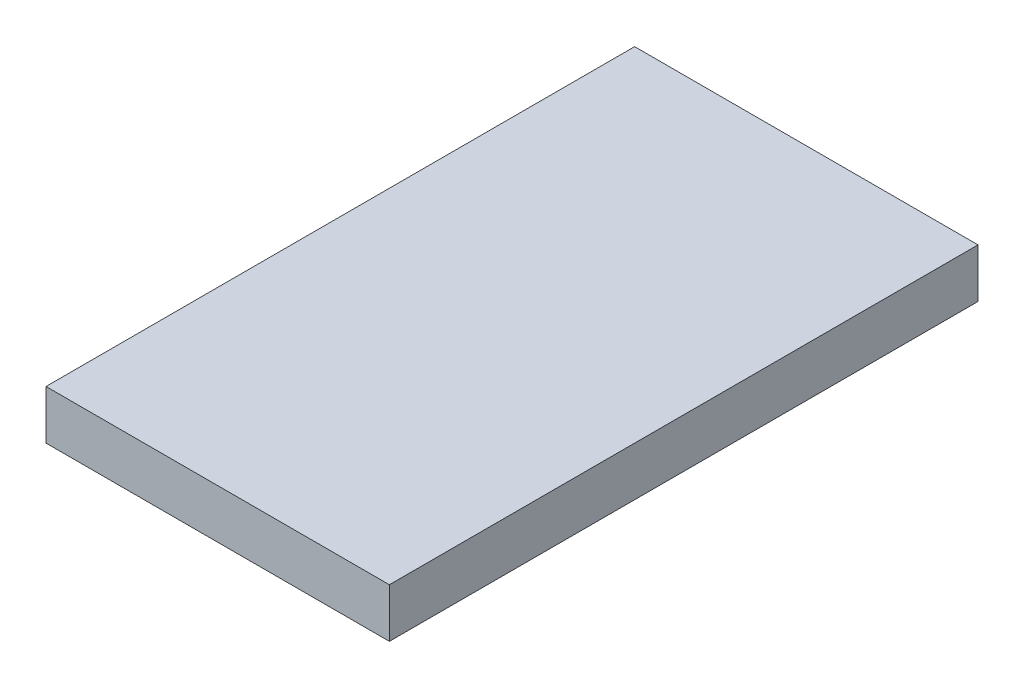
ISO-10303-21;
HEADER;
FILE_DESCRIPTION(('STEP AP214'),'2;1');
FILE_NAME('part.step','',(''),(''),'','','');
FILE_SCHEMA(('AUTOMOTIVE_DESIGN { 1 0 10303 214 1 1 1 1 }'));
ENDSEC;
DATA;
#1=APPLICATION_CONTEXT('core data for automotive mechanical design processes');
#2=APPLICATION_PROTOCOL_DEFINITION('international standard','automotive_design',2000,#1);
#3=PRODUCT_CONTEXT('',#1,'mechanical');
#4=PRODUCT('Part','Part','',(#3));
#5=PRODUCT_RELATED_PRODUCT_CATEGORY('part','',(#4));
#6=PRODUCT_DEFINITION_FORMATION('','',#4);
#7=PRODUCT_DEFINITION_CONTEXT('part definition',#1,'design');
#8=PRODUCT_DEFINITION('design','',#6,#7);
#9=PRODUCT_DEFINITION_SHAPE('','',#8);
#10=(LENGTH_UNIT() NAMED_UNIT(*) SI_UNIT(.MILLI.,.METRE.));
#11=(NAMED_UNIT(*) PLANE_ANGLE_UNIT() SI_UNIT($,.RADIAN.));
#12=(NAMED_UNIT(*) SI_UNIT($,.STERADIAN.) SOLID_ANGLE_UNIT());
#13=UNCERTAINTY_MEASURE_WITH_UNIT(LENGTH_MEASURE(1.E-05),#10,'distance_accuracy_value','');
#14=(GEOMETRIC_REPRESENTATION_CONTEXT(3) GLOBAL_UNCERTAINTY_ASSIGNED_CONTEXT((#13)) GLOBAL_UNIT_ASSIGNED_CONTEXT((#10,
#11,#12)) REPRESENTATION_CONTEXT('',''));
#15=CARTESIAN_POINT('',(0.,0.,0.));
#16=DIRECTION('',(0.,0.,1.));
#17=DIRECTION('',(1.,0.,0.));
#18=AXIS2_PLACEMENT_3D('',#15,#16,#17);
#19=CARTESIAN_POINT('',(0.,0.,1200.));
#20=DIRECTION('',(1.,0.,0.));
#21=DIRECTION('',(0.,0.,-1.));
#22=AXIS2_PLACEMENT_3D('',#19,#20,#21);
#23=PLANE('',#22);
#24=DIRECTION('',(0.,-1.,0.));
#25=VECTOR('',#24,1.);
#26=CARTESIAN_POINT('',(0.,0.,0.));
#27=LINE('',#26,#25);
#28=CARTESIAN_POINT('',(0.,100.,0.));
#29=VERTEX_POINT('',#28);
#30=CARTESIAN_POINT('',(0.,0.,0.));
#31=VERTEX_POINT('',#30);
#32=EDGE_CURVE('E107',#29,#31,#27,.T.);
#33=ORIENTED_EDGE('',*,*,#32,.T.);
#34=DIRECTION('',(0.,0.,-1.));
#35=VECTOR('',#34,1.);
#36=CARTESIAN_POINT('',(0.,0.,1200.));
#37=LINE('',#36,#35);
#38=CARTESIAN_POINT('',(0.,0.,1200.));
#39=VERTEX_POINT('',#38);
#40=EDGE_CURVE('E11',#39,#31,#37,.T.);
#41=ORIENTED_EDGE('',*,*,#40,.F.);
#42=DIRECTION('',(0.,-1.,0.));
#43=VECTOR('',#42,1.);
#44=CARTESIAN_POINT('',(0.,0.,1200.));
#45=LINE('',#44,#43);
#46=CARTESIAN_POINT('',(0.,100.,1200.));
#47=VERTEX_POINT('',#46);
#48=EDGE_CURVE('E91',#47,#39,#45,.T.);
#49=ORIENTED_EDGE('',*,*,#48,.F.);
#50=DIRECTION('',(0.,0.,-1.));
#51=VECTOR('',#50,1.);
#52=CARTESIAN_POINT('',(0.,100.,1200.));
#53=LINE('',#52,#51);
#54=EDGE_CURVE('E103',#47,#29,#53,.T.);
#55=ORIENTED_EDGE('',*,*,#54,.T.);
#56=EDGE_LOOP('',(#33,#41,#49,#55));
#57=FACE_BOUND('',#56,.T.);
#58=ADVANCED_FACE('F39',(#57),#23,.F.);
#59=CARTESIAN_POINT('',(0.,0.,1200.));
#60=DIRECTION('',(0.,1.,0.));
#61=DIRECTION('',(0.,0.,1.));
#62=AXIS2_PLACEMENT_3D('',#59,#60,#61);
#63=PLANE('',#62);
#64=DIRECTION('',(1.,0.,0.));
#65=VECTOR('',#64,1.);
#66=CARTESIAN_POINT('',(0.,0.,0.));
#67=LINE('',#66,#65);
#68=CARTESIAN_POINT('',(700.,0.,0.));
#69=VERTEX_POINT('',#68);
#70=EDGE_CURVE('E96',#31,#69,#67,.T.);
#71=ORIENTED_EDGE('',*,*,#70,.T.);
#72=DIRECTION('',(0.,0.,-1.));
#73=VECTOR('',#72,1.);
#74=CARTESIAN_POINT('',(700.,0.,1200.));
#75=LINE('',#74,#73);
#76=CARTESIAN_POINT('',(700.,0.,1200.));
#77=VERTEX_POINT('',#76);
#78=EDGE_CURVE('E48',#77,#69,#75,.T.);
#79=ORIENTED_EDGE('',*,*,#78,.F.);
#80=DIRECTION('',(1.,0.,0.));
#81=VECTOR('',#80,1.);
#82=CARTESIAN_POINT('',(0.,0.,1200.));
#83=LINE('',#82,#81);
#84=EDGE_CURVE('E86',#39,#77,#83,.T.);
#85=ORIENTED_EDGE('',*,*,#84,.F.);
#86=ORIENTED_EDGE('',*,*,#40,.T.);
#87=EDGE_LOOP('',(#71,#79,#85,#86));
#88=FACE_BOUND('',#87,.T.);
#89=ADVANCED_FACE('F95',(#88),#63,.F.);
#90=CARTESIAN_POINT('',(700.,0.,1200.));
#91=DIRECTION('',(-1.,0.,0.));
#92=DIRECTION('',(0.,0.,1.));
#93=AXIS2_PLACEMENT_3D('',#90,#91,#92);
#94=PLANE('',#93);
#95=DIRECTION('',(0.,1.,0.));
#96=VECTOR('',#95,1.);
#97=CARTESIAN_POINT('',(700.,0.,0.));
#98=LINE('',#97,#96);
#99=CARTESIAN_POINT('',(700.,100.,0.));
#100=VERTEX_POINT('',#99);
#101=EDGE_CURVE('E73',#69,#100,#98,.T.);
#102=ORIENTED_EDGE('',*,*,#101,.T.);
#103=DIRECTION('',(0.,0.,-1.));
#104=VECTOR('',#103,1.);
#105=CARTESIAN_POINT('',(700.,100.,1200.));
#106=LINE('',#105,#104);
#107=CARTESIAN_POINT('',(700.,100.,1200.));
#108=VERTEX_POINT('',#107);
#109=EDGE_CURVE('E98',#108,#100,#106,.T.);
#110=ORIENTED_EDGE('',*,*,#109,.F.);
#111=DIRECTION('',(0.,1.,0.));
#112=VECTOR('',#111,1.);
#113=CARTESIAN_POINT('',(700.,0.,1200.));
#114=LINE('',#113,#112);
#115=EDGE_CURVE('E89',#77,#108,#114,.T.);
#116=ORIENTED_EDGE('',*,*,#115,.F.);
#117=ORIENTED_EDGE('',*,*,#78,.T.);
#118=EDGE_LOOP('',(#102,#110,#116,#117));
#119=FACE_BOUND('',#118,.T.);
#120=ADVANCED_FACE('F99',(#119),#94,.F.);
#121=CARTESIAN_POINT('',(0.,100.,1200.));
#122=DIRECTION('',(0.,-1.,0.));
#123=DIRECTION('',(0.,0.,-1.));
#124=AXIS2_PLACEMENT_3D('',#121,#122,#123);
#125=PLANE('',#124);
#126=DIRECTION('',(-1.,0.,0.));
#127=VECTOR('',#126,1.);
#128=CARTESIAN_POINT('',(0.,100.,0.));
#129=LINE('',#128,#127);
#130=EDGE_CURVE('E79',#100,#29,#129,.T.);
#131=ORIENTED_EDGE('',*,*,#130,.T.);
#132=ORIENTED_EDGE('',*,*,#54,.F.);
#133=DIRECTION('',(-1.,0.,0.));
#134=VECTOR('',#133,1.);
#135=CARTESIAN_POINT('',(0.,100.,1200.));
#136=LINE('',#135,#134);
#137=EDGE_CURVE('E56',#108,#47,#136,.T.);
#138=ORIENTED_EDGE('',*,*,#137,.F.);
#139=ORIENTED_EDGE('',*,*,#109,.T.);
#140=EDGE_LOOP('',(#131,#132,#138,#139));
#141=FACE_BOUND('',#140,.T.);
#142=ADVANCED_FACE('F120',(#141),#125,.F.);
#143=CARTESIAN_POINT('',(0.,0.,1200.));
#144=DIRECTION('',(0.,0.,-1.));
#145=DIRECTION('',(-1.,0.,0.));
#146=AXIS2_PLACEMENT_3D('',#143,#144,#145);
#147=PLANE('',#146);
#148=ORIENTED_EDGE('',*,*,#48,.T.);
#149=ORIENTED_EDGE('',*,*,#84,.T.);
#150=ORIENTED_EDGE('',*,*,#115,.T.);
#151=ORIENTED_EDGE('',*,*,#137,.T.);
#152=EDGE_LOOP('',(#148,#149,#150,#151));
#153=FACE_BOUND('',#152,.T.);
#154=ADVANCED_FACE('F87',(#153),#147,.F.);
#155=CARTESIAN_POINT('',(0.,0.,0.));
#156=DIRECTION('',(0.,0.,-1.));
#157=DIRECTION('',(-1.,0.,0.));
#158=AXIS2_PLACEMENT_3D('',#155,#156,#157);
#159=PLANE('',#158);
#160=ORIENTED_EDGE('',*,*,#32,.F.);
#161=ORIENTED_EDGE('',*,*,#130,.F.);
#162=ORIENTED_EDGE('',*,*,#101,.F.);
#163=ORIENTED_EDGE('',*,*,#70,.F.);
#164=EDGE_LOOP('',(#160,#161,#162,#163));
#165=FACE_BOUND('',#164,.T.);
#166=ADVANCED_FACE('F123',(#165),#159,.T.);
#167=CLOSED_SHELL('',(#58,#89,#120,#142,#154,#166));
#168=MANIFOLD_SOLID_BREP('B2',#167);
#169=ADVANCED_BREP_SHAPE_REPRESENTATION('',(#18,#168),#14);
#170=SHAPE_DEFINITION_REPRESENTATION(#9,#169);
ENDSEC;
END-ISO-10303-21;
